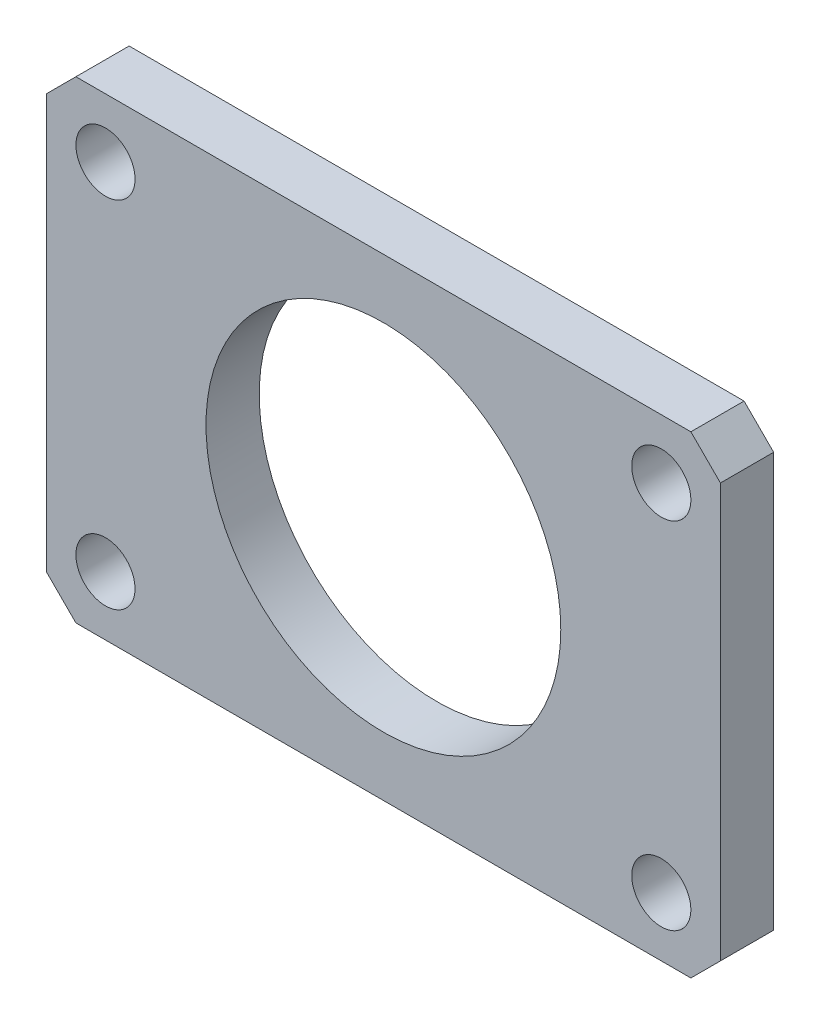
ISO-10303-21;
HEADER;
FILE_DESCRIPTION(('STEP AP214'),'2;1');
FILE_NAME('part.step','',(''),(''),'','','');
FILE_SCHEMA(('AUTOMOTIVE_DESIGN { 1 0 10303 214 1 1 1 1 }'));
ENDSEC;
DATA;
#1=APPLICATION_CONTEXT('core data for automotive mechanical design processes');
#2=APPLICATION_PROTOCOL_DEFINITION('international standard','automotive_design',2000,#1);
#3=PRODUCT_CONTEXT('',#1,'mechanical');
#4=PRODUCT('Part','Part','',(#3));
#5=PRODUCT_RELATED_PRODUCT_CATEGORY('part','',(#4));
#6=PRODUCT_DEFINITION_FORMATION('','',#4);
#7=PRODUCT_DEFINITION_CONTEXT('part definition',#1,'design');
#8=PRODUCT_DEFINITION('design','',#6,#7);
#9=PRODUCT_DEFINITION_SHAPE('','',#8);
#10=(LENGTH_UNIT() NAMED_UNIT(*) SI_UNIT(.MILLI.,.METRE.));
#11=(NAMED_UNIT(*) PLANE_ANGLE_UNIT() SI_UNIT($,.RADIAN.));
#12=(NAMED_UNIT(*) SI_UNIT($,.STERADIAN.) SOLID_ANGLE_UNIT());
#13=UNCERTAINTY_MEASURE_WITH_UNIT(LENGTH_MEASURE(1.E-05),#10,'distance_accuracy_value','');
#14=(GEOMETRIC_REPRESENTATION_CONTEXT(3) GLOBAL_UNCERTAINTY_ASSIGNED_CONTEXT((#13)) GLOBAL_UNIT_ASSIGNED_CONTEXT((#10,
#11,#12)) REPRESENTATION_CONTEXT('',''));
#15=CARTESIAN_POINT('',(0.,0.,0.));
#16=DIRECTION('',(0.,0.,1.));
#17=DIRECTION('',(1.,0.,0.));
#18=AXIS2_PLACEMENT_3D('',#15,#16,#17);
#19=CARTESIAN_POINT('',(0.,0.,4.5));
#20=DIRECTION('',(0.,0.,-1.));
#21=DIRECTION('',(-1.,0.,0.));
#22=AXIS2_PLACEMENT_3D('',#19,#20,#21);
#23=PLANE('',#22);
#24=CARTESIAN_POINT('',(-14.25,-10.,4.5));
#25=DIRECTION('',(0.,0.,1.));
#26=DIRECTION('',(1.,0.,0.));
#27=AXIS2_PLACEMENT_3D('',#24,#25,#26);
#28=CIRCLE('',#27,15.);
#29=CARTESIAN_POINT('',(0.749999999999994,-10.,4.5));
#30=VERTEX_POINT('',#29);
#31=EDGE_CURVE('E337',#30,#30,#28,.T.);
#32=ORIENTED_EDGE('',*,*,#31,.F.);
#33=EDGE_LOOP('',(#32));
#34=FACE_BOUND('',#33,.T.);
#35=DIRECTION('',(0.,1.,0.));
#36=VECTOR('',#35,1.);
#37=CARTESIAN_POINT('',(14.25,-10.,4.5));
#38=LINE('',#37,#36);
#39=CARTESIAN_POINT('',(14.25,-27.5,4.5));
#40=VERTEX_POINT('',#39);
#41=CARTESIAN_POINT('',(14.25,7.49999999999999,4.5));
#42=VERTEX_POINT('',#41);
#43=EDGE_CURVE('E172',#40,#42,#38,.T.);
#44=ORIENTED_EDGE('',*,*,#43,.T.);
#45=DIRECTION('',(0.707106781186547,-0.707106781186549,0.));
#46=VECTOR('',#45,1.);
#47=CARTESIAN_POINT('',(11.75,10.,4.5));
#48=LINE('',#47,#46);
#49=CARTESIAN_POINT('',(11.75,10.,4.5));
#50=VERTEX_POINT('',#49);
#51=EDGE_CURVE('E11',#42,#50,#48,.F.);
#52=ORIENTED_EDGE('',*,*,#51,.T.);
#53=DIRECTION('',(-1.,0.,0.));
#54=VECTOR('',#53,1.);
#55=CARTESIAN_POINT('',(-14.25,10.,4.5));
#56=LINE('',#55,#54);
#57=CARTESIAN_POINT('',(-40.25,10.,4.5));
#58=VERTEX_POINT('',#57);
#59=EDGE_CURVE('E174',#50,#58,#56,.T.);
#60=ORIENTED_EDGE('',*,*,#59,.T.);
#61=DIRECTION('',(-0.707106781186547,-0.707106781186549,0.));
#62=VECTOR('',#61,1.);
#63=CARTESIAN_POINT('',(-40.25,10.,4.5));
#64=LINE('',#63,#62);
#65=CARTESIAN_POINT('',(-42.75,7.49999999999999,4.5));
#66=VERTEX_POINT('',#65);
#67=EDGE_CURVE('E147',#66,#58,#64,.F.);
#68=ORIENTED_EDGE('',*,*,#67,.F.);
#69=DIRECTION('',(0.,1.,0.));
#70=VECTOR('',#69,1.);
#71=CARTESIAN_POINT('',(-42.75,-10.,4.5));
#72=LINE('',#71,#70);
#73=CARTESIAN_POINT('',(-42.75,-27.5,4.5));
#74=VERTEX_POINT('',#73);
#75=EDGE_CURVE('E135',#74,#66,#72,.T.);
#76=ORIENTED_EDGE('',*,*,#75,.F.);
#77=DIRECTION('',(-0.707106781186547,0.707106781186549,0.));
#78=VECTOR('',#77,1.);
#79=CARTESIAN_POINT('',(-40.25,-30.,4.5));
#80=LINE('',#79,#78);
#81=CARTESIAN_POINT('',(-40.25,-30.,4.5));
#82=VERTEX_POINT('',#81);
#83=EDGE_CURVE('E123',#74,#82,#80,.F.);
#84=ORIENTED_EDGE('',*,*,#83,.T.);
#85=DIRECTION('',(-1.,0.,0.));
#86=VECTOR('',#85,1.);
#87=CARTESIAN_POINT('',(-14.25,-30.,4.5));
#88=LINE('',#87,#86);
#89=CARTESIAN_POINT('',(11.75,-30.,4.5));
#90=VERTEX_POINT('',#89);
#91=EDGE_CURVE('E107',#90,#82,#88,.T.);
#92=ORIENTED_EDGE('',*,*,#91,.F.);
#93=DIRECTION('',(0.707106781186547,0.707106781186549,0.));
#94=VECTOR('',#93,1.);
#95=CARTESIAN_POINT('',(11.75,-30.,4.5));
#96=LINE('',#95,#94);
#97=EDGE_CURVE('E162',#40,#90,#96,.F.);
#98=ORIENTED_EDGE('',*,*,#97,.F.);
#99=EDGE_LOOP('',(#44,#52,#60,#68,#76,#84,#92,#98));
#100=FACE_BOUND('',#99,.T.);
#101=CARTESIAN_POINT('',(9.24999999999999,5.,4.5));
#102=DIRECTION('',(0.,0.,1.));
#103=DIRECTION('',(1.,0.,0.));
#104=AXIS2_PLACEMENT_3D('',#101,#102,#103);
#105=CIRCLE('',#104,2.5);
#106=CARTESIAN_POINT('',(11.75,5.,4.5));
#107=VERTEX_POINT('',#106);
#108=EDGE_CURVE('E166',#107,#107,#105,.T.);
#109=ORIENTED_EDGE('',*,*,#108,.F.);
#110=EDGE_LOOP('',(#109));
#111=FACE_BOUND('',#110,.T.);
#112=CARTESIAN_POINT('',(9.24999999999999,-25.,4.5));
#113=DIRECTION('',(0.,0.,-1.));
#114=DIRECTION('',(1.,0.,0.));
#115=AXIS2_PLACEMENT_3D('',#112,#113,#114);
#116=CIRCLE('',#115,2.5);
#117=CARTESIAN_POINT('',(11.75,-25.,4.5));
#118=VERTEX_POINT('',#117);
#119=EDGE_CURVE('E108',#118,#118,#116,.T.);
#120=ORIENTED_EDGE('',*,*,#119,.T.);
#121=EDGE_LOOP('',(#120));
#122=FACE_BOUND('',#121,.T.);
#123=CARTESIAN_POINT('',(-37.75,5.,4.5));
#124=DIRECTION('',(0.,0.,-1.));
#125=DIRECTION('',(-1.,0.,0.));
#126=AXIS2_PLACEMENT_3D('',#123,#124,#125);
#127=CIRCLE('',#126,2.5);
#128=CARTESIAN_POINT('',(-40.25,5.,4.5));
#129=VERTEX_POINT('',#128);
#130=EDGE_CURVE('E129',#129,#129,#127,.T.);
#131=ORIENTED_EDGE('',*,*,#130,.T.);
#132=EDGE_LOOP('',(#131));
#133=FACE_BOUND('',#132,.T.);
#134=CARTESIAN_POINT('',(-37.75,-25.,4.5));
#135=DIRECTION('',(0.,0.,1.));
#136=DIRECTION('',(-1.,0.,0.));
#137=AXIS2_PLACEMENT_3D('',#134,#135,#136);
#138=CIRCLE('',#137,2.5);
#139=CARTESIAN_POINT('',(-40.25,-25.,4.5));
#140=VERTEX_POINT('',#139);
#141=EDGE_CURVE('E117',#140,#140,#138,.T.);
#142=ORIENTED_EDGE('',*,*,#141,.F.);
#143=EDGE_LOOP('',(#142));
#144=FACE_BOUND('',#143,.T.);
#145=ADVANCED_FACE('F34',(#34,#100,#111,#122,#133,#144),#23,.F.);
#146=CARTESIAN_POINT('',(0.,0.,0.));
#147=DIRECTION('',(0.,0.,-1.));
#148=DIRECTION('',(-1.,0.,0.));
#149=AXIS2_PLACEMENT_3D('',#146,#147,#148);
#150=PLANE('',#149);
#151=CARTESIAN_POINT('',(-14.25,-10.,0.));
#152=DIRECTION('',(0.,0.,1.));
#153=DIRECTION('',(1.,0.,0.));
#154=AXIS2_PLACEMENT_3D('',#151,#152,#153);
#155=CIRCLE('',#154,15.);
#156=CARTESIAN_POINT('',(0.749999999999994,-10.,0.));
#157=VERTEX_POINT('',#156);
#158=EDGE_CURVE('E335',#157,#157,#155,.T.);
#159=ORIENTED_EDGE('',*,*,#158,.T.);
#160=EDGE_LOOP('',(#159));
#161=FACE_BOUND('',#160,.T.);
#162=DIRECTION('',(-1.,0.,0.));
#163=VECTOR('',#162,1.);
#164=CARTESIAN_POINT('',(-14.25,10.,0.));
#165=LINE('',#164,#163);
#166=CARTESIAN_POINT('',(11.75,10.,0.));
#167=VERTEX_POINT('',#166);
#168=CARTESIAN_POINT('',(-40.25,10.,0.));
#169=VERTEX_POINT('',#168);
#170=EDGE_CURVE('E175',#167,#169,#165,.T.);
#171=ORIENTED_EDGE('',*,*,#170,.F.);
#172=DIRECTION('',(-0.707106781186547,0.707106781186549,0.));
#173=VECTOR('',#172,1.);
#174=CARTESIAN_POINT('',(10.875,10.875,0.));
#175=LINE('',#174,#173);
#176=CARTESIAN_POINT('',(14.25,7.49999999999999,0.));
#177=VERTEX_POINT('',#176);
#178=EDGE_CURVE('E56',#167,#177,#175,.F.);
#179=ORIENTED_EDGE('',*,*,#178,.T.);
#180=DIRECTION('',(0.,1.,0.));
#181=VECTOR('',#180,1.);
#182=CARTESIAN_POINT('',(14.25,-10.,0.));
#183=LINE('',#182,#181);
#184=CARTESIAN_POINT('',(14.25,-27.5,0.));
#185=VERTEX_POINT('',#184);
#186=EDGE_CURVE('E169',#185,#177,#183,.T.);
#187=ORIENTED_EDGE('',*,*,#186,.F.);
#188=DIRECTION('',(-0.707106781186547,-0.707106781186549,0.));
#189=VECTOR('',#188,1.);
#190=CARTESIAN_POINT('',(10.875,-30.875,0.));
#191=LINE('',#190,#189);
#192=CARTESIAN_POINT('',(11.75,-30.,0.));
#193=VERTEX_POINT('',#192);
#194=EDGE_CURVE('E105',#193,#185,#191,.F.);
#195=ORIENTED_EDGE('',*,*,#194,.F.);
#196=DIRECTION('',(-1.,0.,0.));
#197=VECTOR('',#196,1.);
#198=CARTESIAN_POINT('',(-14.25,-30.,0.));
#199=LINE('',#198,#197);
#200=CARTESIAN_POINT('',(-40.25,-30.,0.));
#201=VERTEX_POINT('',#200);
#202=EDGE_CURVE('E97',#193,#201,#199,.T.);
#203=ORIENTED_EDGE('',*,*,#202,.T.);
#204=DIRECTION('',(0.707106781186547,-0.707106781186549,0.));
#205=VECTOR('',#204,1.);
#206=CARTESIAN_POINT('',(-39.375,-30.875,0.));
#207=LINE('',#206,#205);
#208=CARTESIAN_POINT('',(-42.75,-27.5,0.));
#209=VERTEX_POINT('',#208);
#210=EDGE_CURVE('E103',#201,#209,#207,.F.);
#211=ORIENTED_EDGE('',*,*,#210,.T.);
#212=DIRECTION('',(0.,1.,0.));
#213=VECTOR('',#212,1.);
#214=CARTESIAN_POINT('',(-42.75,-10.,0.));
#215=LINE('',#214,#213);
#216=CARTESIAN_POINT('',(-42.75,7.49999999999999,0.));
#217=VERTEX_POINT('',#216);
#218=EDGE_CURVE('E132',#209,#217,#215,.T.);
#219=ORIENTED_EDGE('',*,*,#218,.T.);
#220=DIRECTION('',(0.707106781186547,0.707106781186549,0.));
#221=VECTOR('',#220,1.);
#222=CARTESIAN_POINT('',(-39.375,10.875,0.));
#223=LINE('',#222,#221);
#224=EDGE_CURVE('E142',#169,#217,#223,.F.);
#225=ORIENTED_EDGE('',*,*,#224,.F.);
#226=EDGE_LOOP('',(#171,#179,#187,#195,#203,#211,#219,#225));
#227=FACE_BOUND('',#226,.T.);
#228=CARTESIAN_POINT('',(9.24999999999999,5.,0.));
#229=DIRECTION('',(0.,0.,1.));
#230=DIRECTION('',(1.,0.,0.));
#231=AXIS2_PLACEMENT_3D('',#228,#229,#230);
#232=CIRCLE('',#231,2.5);
#233=CARTESIAN_POINT('',(11.75,5.,0.));
#234=VERTEX_POINT('',#233);
#235=EDGE_CURVE('E165',#234,#234,#232,.T.);
#236=ORIENTED_EDGE('',*,*,#235,.T.);
#237=EDGE_LOOP('',(#236));
#238=FACE_BOUND('',#237,.T.);
#239=CARTESIAN_POINT('',(9.24999999999999,-25.,0.));
#240=DIRECTION('',(0.,0.,-1.));
#241=DIRECTION('',(1.,0.,0.));
#242=AXIS2_PLACEMENT_3D('',#239,#240,#241);
#243=CIRCLE('',#242,2.5);
#244=CARTESIAN_POINT('',(11.75,-25.,0.));
#245=VERTEX_POINT('',#244);
#246=EDGE_CURVE('E150',#245,#245,#243,.T.);
#247=ORIENTED_EDGE('',*,*,#246,.F.);
#248=EDGE_LOOP('',(#247));
#249=FACE_BOUND('',#248,.T.);
#250=CARTESIAN_POINT('',(-37.75,5.,0.));
#251=DIRECTION('',(0.,0.,-1.));
#252=DIRECTION('',(-1.,0.,0.));
#253=AXIS2_PLACEMENT_3D('',#250,#251,#252);
#254=CIRCLE('',#253,2.5);
#255=CARTESIAN_POINT('',(-40.25,5.,0.));
#256=VERTEX_POINT('',#255);
#257=EDGE_CURVE('E128',#256,#256,#254,.T.);
#258=ORIENTED_EDGE('',*,*,#257,.F.);
#259=EDGE_LOOP('',(#258));
#260=FACE_BOUND('',#259,.T.);
#261=CARTESIAN_POINT('',(-37.75,-25.,0.));
#262=DIRECTION('',(0.,0.,1.));
#263=DIRECTION('',(-1.,0.,0.));
#264=AXIS2_PLACEMENT_3D('',#261,#262,#263);
#265=CIRCLE('',#264,2.5);
#266=CARTESIAN_POINT('',(-40.25,-25.,0.));
#267=VERTEX_POINT('',#266);
#268=EDGE_CURVE('E339',#267,#267,#265,.T.);
#269=ORIENTED_EDGE('',*,*,#268,.T.);
#270=EDGE_LOOP('',(#269));
#271=FACE_BOUND('',#270,.T.);
#272=ADVANCED_FACE('F99',(#161,#227,#238,#249,#260,#271),#150,.T.);
#273=CARTESIAN_POINT('',(14.25,-10.,4.5));
#274=DIRECTION('',(-1.,0.,0.));
#275=DIRECTION('',(0.,0.,1.));
#276=AXIS2_PLACEMENT_3D('',#273,#274,#275);
#277=PLANE('',#276);
#278=ORIENTED_EDGE('',*,*,#186,.T.);
#279=DIRECTION('',(0.,0.,1.));
#280=VECTOR('',#279,1.);
#281=CARTESIAN_POINT('',(14.25,7.49999999999999,4.5));
#282=LINE('',#281,#280);
#283=EDGE_CURVE('E42',#177,#42,#282,.T.);
#284=ORIENTED_EDGE('',*,*,#283,.T.);
#285=ORIENTED_EDGE('',*,*,#43,.F.);
#286=DIRECTION('',(0.,0.,1.));
#287=VECTOR('',#286,1.);
#288=CARTESIAN_POINT('',(14.25,-27.5,4.5));
#289=LINE('',#288,#287);
#290=EDGE_CURVE('E159',#185,#40,#289,.T.);
#291=ORIENTED_EDGE('',*,*,#290,.F.);
#292=EDGE_LOOP('',(#278,#284,#285,#291));
#293=FACE_BOUND('',#292,.T.);
#294=ADVANCED_FACE('F202',(#293),#277,.F.);
#295=CARTESIAN_POINT('',(-14.25,10.,4.5));
#296=DIRECTION('',(0.,-1.,0.));
#297=DIRECTION('',(0.,0.,-1.));
#298=AXIS2_PLACEMENT_3D('',#295,#296,#297);
#299=PLANE('',#298);
#300=ORIENTED_EDGE('',*,*,#59,.F.);
#301=DIRECTION('',(0.,0.,-1.));
#302=VECTOR('',#301,1.);
#303=CARTESIAN_POINT('',(11.75,10.,4.5));
#304=LINE('',#303,#302);
#305=EDGE_CURVE('E177',#50,#167,#304,.T.);
#306=ORIENTED_EDGE('',*,*,#305,.T.);
#307=ORIENTED_EDGE('',*,*,#170,.T.);
#308=DIRECTION('',(0.,0.,-1.));
#309=VECTOR('',#308,1.);
#310=CARTESIAN_POINT('',(-40.25,10.,4.5));
#311=LINE('',#310,#309);
#312=EDGE_CURVE('E138',#58,#169,#311,.T.);
#313=ORIENTED_EDGE('',*,*,#312,.F.);
#314=EDGE_LOOP('',(#300,#306,#307,#313));
#315=FACE_BOUND('',#314,.T.);
#316=ADVANCED_FACE('F185',(#315),#299,.F.);
#317=CARTESIAN_POINT('',(9.24999999999999,5.,4.5));
#318=DIRECTION('',(0.,0.,-1.));
#319=DIRECTION('',(-1.,0.,0.));
#320=AXIS2_PLACEMENT_3D('',#317,#318,#319);
#321=CYLINDRICAL_SURFACE('',#320,2.5);
#322=ORIENTED_EDGE('',*,*,#108,.T.);
#323=EDGE_LOOP('',(#322));
#324=FACE_BOUND('',#323,.T.);
#325=ORIENTED_EDGE('',*,*,#235,.F.);
#326=EDGE_LOOP('',(#325));
#327=FACE_BOUND('',#326,.T.);
#328=ADVANCED_FACE('F204',(#324,#327),#321,.F.);
#329=CARTESIAN_POINT('',(11.75,10.,4.5));
#330=DIRECTION('',(-0.707106781186549,-0.707106781186547,0.));
#331=DIRECTION('',(0.,0.,-1.));
#332=AXIS2_PLACEMENT_3D('',#329,#330,#331);
#333=PLANE('',#332);
#334=ORIENTED_EDGE('',*,*,#51,.F.);
#335=ORIENTED_EDGE('',*,*,#283,.F.);
#336=ORIENTED_EDGE('',*,*,#178,.F.);
#337=ORIENTED_EDGE('',*,*,#305,.F.);
#338=EDGE_LOOP('',(#334,#335,#336,#337));
#339=FACE_BOUND('',#338,.T.);
#340=ADVANCED_FACE('F36',(#339),#333,.F.);
#341=CARTESIAN_POINT('',(-14.25,-30.,4.5));
#342=DIRECTION('',(0.,1.,0.));
#343=DIRECTION('',(0.,0.,-1.));
#344=AXIS2_PLACEMENT_3D('',#341,#342,#343);
#345=PLANE('',#344);
#346=ORIENTED_EDGE('',*,*,#91,.T.);
#347=DIRECTION('',(0.,0.,-1.));
#348=VECTOR('',#347,1.);
#349=CARTESIAN_POINT('',(-40.25,-30.,4.5));
#350=LINE('',#349,#348);
#351=EDGE_CURVE('E111',#82,#201,#350,.T.);
#352=ORIENTED_EDGE('',*,*,#351,.T.);
#353=ORIENTED_EDGE('',*,*,#202,.F.);
#354=DIRECTION('',(0.,0.,-1.));
#355=VECTOR('',#354,1.);
#356=CARTESIAN_POINT('',(11.75,-30.,4.5));
#357=LINE('',#356,#355);
#358=EDGE_CURVE('E155',#90,#193,#357,.T.);
#359=ORIENTED_EDGE('',*,*,#358,.F.);
#360=EDGE_LOOP('',(#346,#352,#353,#359));
#361=FACE_BOUND('',#360,.T.);
#362=ADVANCED_FACE('F112',(#361),#345,.F.);
#363=CARTESIAN_POINT('',(9.24999999999999,-25.,4.5));
#364=DIRECTION('',(0.,0.,-1.));
#365=DIRECTION('',(-1.,0.,0.));
#366=AXIS2_PLACEMENT_3D('',#363,#364,#365);
#367=CYLINDRICAL_SURFACE('',#366,2.5);
#368=ORIENTED_EDGE('',*,*,#119,.F.);
#369=EDGE_LOOP('',(#368));
#370=FACE_BOUND('',#369,.T.);
#371=ORIENTED_EDGE('',*,*,#246,.T.);
#372=EDGE_LOOP('',(#371));
#373=FACE_BOUND('',#372,.T.);
#374=ADVANCED_FACE('F209',(#370,#373),#367,.F.);
#375=CARTESIAN_POINT('',(11.75,-30.,4.5));
#376=DIRECTION('',(-0.707106781186549,0.707106781186547,0.));
#377=DIRECTION('',(0.,0.,-1.));
#378=AXIS2_PLACEMENT_3D('',#375,#376,#377);
#379=PLANE('',#378);
#380=ORIENTED_EDGE('',*,*,#97,.T.);
#381=ORIENTED_EDGE('',*,*,#358,.T.);
#382=ORIENTED_EDGE('',*,*,#194,.T.);
#383=ORIENTED_EDGE('',*,*,#290,.T.);
#384=EDGE_LOOP('',(#380,#381,#382,#383));
#385=FACE_BOUND('',#384,.T.);
#386=ADVANCED_FACE('F200',(#385),#379,.F.);
#387=CARTESIAN_POINT('',(-42.75,-10.,4.5));
#388=DIRECTION('',(1.,0.,0.));
#389=DIRECTION('',(0.,0.,1.));
#390=AXIS2_PLACEMENT_3D('',#387,#388,#389);
#391=PLANE('',#390);
#392=ORIENTED_EDGE('',*,*,#218,.F.);
#393=DIRECTION('',(0.,0.,1.));
#394=VECTOR('',#393,1.);
#395=CARTESIAN_POINT('',(-42.75,-27.5,4.5));
#396=LINE('',#395,#394);
#397=EDGE_CURVE('E120',#209,#74,#396,.T.);
#398=ORIENTED_EDGE('',*,*,#397,.T.);
#399=ORIENTED_EDGE('',*,*,#75,.T.);
#400=DIRECTION('',(0.,0.,1.));
#401=VECTOR('',#400,1.);
#402=CARTESIAN_POINT('',(-42.75,7.49999999999999,4.5));
#403=LINE('',#402,#401);
#404=EDGE_CURVE('E145',#217,#66,#403,.T.);
#405=ORIENTED_EDGE('',*,*,#404,.F.);
#406=EDGE_LOOP('',(#392,#398,#399,#405));
#407=FACE_BOUND('',#406,.T.);
#408=ADVANCED_FACE('F197',(#407),#391,.F.);
#409=CARTESIAN_POINT('',(-37.75,5.,4.5));
#410=DIRECTION('',(0.,0.,-1.));
#411=DIRECTION('',(1.,0.,0.));
#412=AXIS2_PLACEMENT_3D('',#409,#410,#411);
#413=CYLINDRICAL_SURFACE('',#412,2.5);
#414=ORIENTED_EDGE('',*,*,#130,.F.);
#415=EDGE_LOOP('',(#414));
#416=FACE_BOUND('',#415,.T.);
#417=ORIENTED_EDGE('',*,*,#257,.T.);
#418=EDGE_LOOP('',(#417));
#419=FACE_BOUND('',#418,.T.);
#420=ADVANCED_FACE('F292',(#416,#419),#413,.F.);
#421=CARTESIAN_POINT('',(-40.25,10.,4.5));
#422=DIRECTION('',(0.707106781186549,-0.707106781186547,0.));
#423=DIRECTION('',(0.,0.,-1.));
#424=AXIS2_PLACEMENT_3D('',#421,#422,#423);
#425=PLANE('',#424);
#426=ORIENTED_EDGE('',*,*,#67,.T.);
#427=ORIENTED_EDGE('',*,*,#312,.T.);
#428=ORIENTED_EDGE('',*,*,#224,.T.);
#429=ORIENTED_EDGE('',*,*,#404,.T.);
#430=EDGE_LOOP('',(#426,#427,#428,#429));
#431=FACE_BOUND('',#430,.T.);
#432=ADVANCED_FACE('F191',(#431),#425,.F.);
#433=CARTESIAN_POINT('',(-37.75,-25.,4.5));
#434=DIRECTION('',(0.,0.,-1.));
#435=DIRECTION('',(1.,0.,0.));
#436=AXIS2_PLACEMENT_3D('',#433,#434,#435);
#437=CYLINDRICAL_SURFACE('',#436,2.5);
#438=ORIENTED_EDGE('',*,*,#141,.T.);
#439=EDGE_LOOP('',(#438));
#440=FACE_BOUND('',#439,.T.);
#441=ORIENTED_EDGE('',*,*,#268,.F.);
#442=EDGE_LOOP('',(#441));
#443=FACE_BOUND('',#442,.T.);
#444=ADVANCED_FACE('F309',(#440,#443),#437,.F.);
#445=CARTESIAN_POINT('',(-40.25,-30.,4.5));
#446=DIRECTION('',(0.707106781186549,0.707106781186547,0.));
#447=DIRECTION('',(0.,0.,-1.));
#448=AXIS2_PLACEMENT_3D('',#445,#446,#447);
#449=PLANE('',#448);
#450=ORIENTED_EDGE('',*,*,#83,.F.);
#451=ORIENTED_EDGE('',*,*,#397,.F.);
#452=ORIENTED_EDGE('',*,*,#210,.F.);
#453=ORIENTED_EDGE('',*,*,#351,.F.);
#454=EDGE_LOOP('',(#450,#451,#452,#453));
#455=FACE_BOUND('',#454,.T.);
#456=ADVANCED_FACE('F119',(#455),#449,.F.);
#457=CARTESIAN_POINT('',(-14.25,-10.,0.));
#458=DIRECTION('',(0.,0.,1.));
#459=DIRECTION('',(1.,0.,0.));
#460=AXIS2_PLACEMENT_3D('',#457,#458,#459);
#461=CYLINDRICAL_SURFACE('',#460,15.);
#462=ORIENTED_EDGE('',*,*,#158,.F.);
#463=EDGE_LOOP('',(#462));
#464=FACE_BOUND('',#463,.T.);
#465=ORIENTED_EDGE('',*,*,#31,.T.);
#466=EDGE_LOOP('',(#465));
#467=FACE_BOUND('',#466,.T.);
#468=ADVANCED_FACE('F323',(#464,#467),#461,.F.);
#469=CLOSED_SHELL('',(#145,#272,#294,#316,#328,#340,#362,#374,#386,#408,#420,#432,#444,#456,#468));
#470=MANIFOLD_SOLID_BREP('B2',#469);
#471=ADVANCED_BREP_SHAPE_REPRESENTATION('',(#18,#470),#14);
#472=SHAPE_DEFINITION_REPRESENTATION(#9,#471);
ENDSEC;
END-ISO-10303-21;
